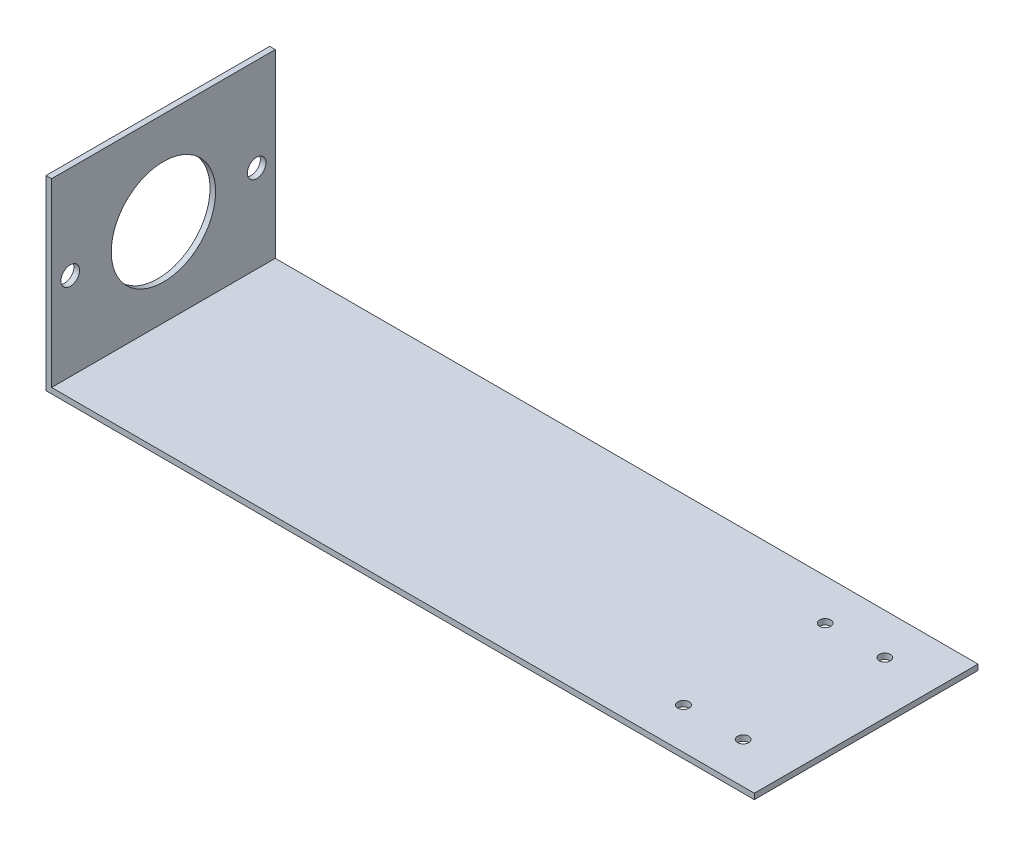
ISO-10303-21;
HEADER;
FILE_DESCRIPTION(('STEP AP214'),'2;1');
FILE_NAME('part.step','',(''),(''),'','','');
FILE_SCHEMA(('AUTOMOTIVE_DESIGN { 1 0 10303 214 1 1 1 1 }'));
ENDSEC;
DATA;
#1=APPLICATION_CONTEXT('core data for automotive mechanical design processes');
#2=APPLICATION_PROTOCOL_DEFINITION('international standard','automotive_design',2000,#1);
#3=PRODUCT_CONTEXT('',#1,'mechanical');
#4=PRODUCT('Part','Part','',(#3));
#5=PRODUCT_RELATED_PRODUCT_CATEGORY('part','',(#4));
#6=PRODUCT_DEFINITION_FORMATION('','',#4);
#7=PRODUCT_DEFINITION_CONTEXT('part definition',#1,'design');
#8=PRODUCT_DEFINITION('design','',#6,#7);
#9=PRODUCT_DEFINITION_SHAPE('','',#8);
#10=(LENGTH_UNIT() NAMED_UNIT(*) SI_UNIT(.MILLI.,.METRE.));
#11=(NAMED_UNIT(*) PLANE_ANGLE_UNIT() SI_UNIT($,.RADIAN.));
#12=(NAMED_UNIT(*) SI_UNIT($,.STERADIAN.) SOLID_ANGLE_UNIT());
#13=UNCERTAINTY_MEASURE_WITH_UNIT(LENGTH_MEASURE(1.E-05),#10,'distance_accuracy_value','');
#14=(GEOMETRIC_REPRESENTATION_CONTEXT(3) GLOBAL_UNCERTAINTY_ASSIGNED_CONTEXT((#13)) GLOBAL_UNIT_ASSIGNED_CONTEXT((#10,
#11,#12)) REPRESENTATION_CONTEXT('',''));
#15=CARTESIAN_POINT('',(0.,0.,0.));
#16=DIRECTION('',(0.,0.,1.));
#17=DIRECTION('',(1.,0.,0.));
#18=AXIS2_PLACEMENT_3D('',#15,#16,#17);
#19=CARTESIAN_POINT('',(190.,0.,60.));
#20=DIRECTION('',(0.,1.,0.));
#21=DIRECTION('',(-1.,0.,0.));
#22=AXIS2_PLACEMENT_3D('',#19,#20,#21);
#23=PLANE('',#22);
#24=CARTESIAN_POINT('',(160.,0.,49.));
#25=DIRECTION('',(0.,1.,0.));
#26=DIRECTION('',(-1.,0.,0.));
#27=AXIS2_PLACEMENT_3D('',#24,#25,#26);
#28=CIRCLE('',#27,1.5);
#29=CARTESIAN_POINT('',(158.5,0.,49.));
#30=VERTEX_POINT('',#29);
#31=EDGE_CURVE('E184',#30,#30,#28,.F.);
#32=ORIENTED_EDGE('',*,*,#31,.F.);
#33=EDGE_LOOP('',(#32));
#34=FACE_BOUND('',#33,.T.);
#35=CARTESIAN_POINT('',(176.,0.,49.));
#36=DIRECTION('',(0.,1.,0.));
#37=DIRECTION('',(-1.,0.,0.));
#38=AXIS2_PLACEMENT_3D('',#35,#36,#37);
#39=CIRCLE('',#38,1.5);
#40=CARTESIAN_POINT('',(174.5,0.,49.));
#41=VERTEX_POINT('',#40);
#42=EDGE_CURVE('E188',#41,#41,#39,.F.);
#43=ORIENTED_EDGE('',*,*,#42,.F.);
#44=EDGE_LOOP('',(#43));
#45=FACE_BOUND('',#44,.T.);
#46=CARTESIAN_POINT('',(176.,0.,11.));
#47=DIRECTION('',(0.,1.,0.));
#48=DIRECTION('',(-1.,0.,0.));
#49=AXIS2_PLACEMENT_3D('',#46,#47,#48);
#50=CIRCLE('',#49,1.5);
#51=CARTESIAN_POINT('',(174.5,0.,11.));
#52=VERTEX_POINT('',#51);
#53=EDGE_CURVE('E192',#52,#52,#50,.F.);
#54=ORIENTED_EDGE('',*,*,#53,.F.);
#55=EDGE_LOOP('',(#54));
#56=FACE_BOUND('',#55,.T.);
#57=CARTESIAN_POINT('',(160.,0.,11.));
#58=DIRECTION('',(0.,1.,0.));
#59=DIRECTION('',(-1.,0.,0.));
#60=AXIS2_PLACEMENT_3D('',#57,#58,#59);
#61=CIRCLE('',#60,1.5);
#62=CARTESIAN_POINT('',(158.5,0.,11.));
#63=VERTEX_POINT('',#62);
#64=EDGE_CURVE('E195',#63,#63,#61,.F.);
#65=ORIENTED_EDGE('',*,*,#64,.F.);
#66=EDGE_LOOP('',(#65));
#67=FACE_BOUND('',#66,.T.);
#68=DIRECTION('',(1.,0.,0.));
#69=VECTOR('',#68,1.);
#70=CARTESIAN_POINT('',(190.,0.,0.));
#71=LINE('',#70,#69);
#72=CARTESIAN_POINT('',(0.,0.,0.));
#73=VERTEX_POINT('',#72);
#74=CARTESIAN_POINT('',(190.,0.,0.));
#75=VERTEX_POINT('',#74);
#76=EDGE_CURVE('E128',#73,#75,#71,.T.);
#77=ORIENTED_EDGE('',*,*,#76,.T.);
#78=DIRECTION('',(0.,0.,-1.));
#79=VECTOR('',#78,1.);
#80=CARTESIAN_POINT('',(190.,0.,60.));
#81=LINE('',#80,#79);
#82=CARTESIAN_POINT('',(190.,0.,60.));
#83=VERTEX_POINT('',#82);
#84=EDGE_CURVE('E11',#83,#75,#81,.T.);
#85=ORIENTED_EDGE('',*,*,#84,.F.);
#86=DIRECTION('',(1.,0.,0.));
#87=VECTOR('',#86,1.);
#88=CARTESIAN_POINT('',(190.,0.,60.));
#89=LINE('',#88,#87);
#90=CARTESIAN_POINT('',(0.,0.,60.));
#91=VERTEX_POINT('',#90);
#92=EDGE_CURVE('E145',#91,#83,#89,.T.);
#93=ORIENTED_EDGE('',*,*,#92,.F.);
#94=DIRECTION('',(0.,0.,-1.));
#95=VECTOR('',#94,1.);
#96=CARTESIAN_POINT('',(0.,0.,60.));
#97=LINE('',#96,#95);
#98=EDGE_CURVE('E124',#91,#73,#97,.T.);
#99=ORIENTED_EDGE('',*,*,#98,.T.);
#100=EDGE_LOOP('',(#77,#85,#93,#99));
#101=FACE_BOUND('',#100,.T.);
#102=ADVANCED_FACE('F39',(#34,#45,#56,#67,#101),#23,.F.);
#103=CARTESIAN_POINT('',(190.,1.49999999999998,60.));
#104=DIRECTION('',(-1.,0.,0.));
#105=DIRECTION('',(0.,0.,1.));
#106=AXIS2_PLACEMENT_3D('',#103,#104,#105);
#107=PLANE('',#106);
#108=DIRECTION('',(0.,1.,0.));
#109=VECTOR('',#108,1.);
#110=CARTESIAN_POINT('',(190.,1.49999999999998,0.));
#111=LINE('',#110,#109);
#112=CARTESIAN_POINT('',(190.,1.49999999999998,0.));
#113=VERTEX_POINT('',#112);
#114=EDGE_CURVE('E132',#75,#113,#111,.T.);
#115=ORIENTED_EDGE('',*,*,#114,.T.);
#116=DIRECTION('',(0.,0.,-1.));
#117=VECTOR('',#116,1.);
#118=CARTESIAN_POINT('',(190.,1.49999999999998,60.));
#119=LINE('',#118,#117);
#120=CARTESIAN_POINT('',(190.,1.49999999999998,60.));
#121=VERTEX_POINT('',#120);
#122=EDGE_CURVE('E48',#121,#113,#119,.T.);
#123=ORIENTED_EDGE('',*,*,#122,.F.);
#124=DIRECTION('',(0.,1.,0.));
#125=VECTOR('',#124,1.);
#126=CARTESIAN_POINT('',(190.,1.49999999999998,60.));
#127=LINE('',#126,#125);
#128=EDGE_CURVE('E93',#83,#121,#127,.T.);
#129=ORIENTED_EDGE('',*,*,#128,.F.);
#130=ORIENTED_EDGE('',*,*,#84,.T.);
#131=EDGE_LOOP('',(#115,#123,#129,#130));
#132=FACE_BOUND('',#131,.T.);
#133=ADVANCED_FACE('F176',(#132),#107,.F.);
#134=CARTESIAN_POINT('',(1.50000000000001,1.49999999999998,60.));
#135=DIRECTION('',(0.,-1.,0.));
#136=DIRECTION('',(1.,0.,0.));
#137=AXIS2_PLACEMENT_3D('',#134,#135,#136);
#138=PLANE('',#137);
#139=CARTESIAN_POINT('',(160.,1.49999999999998,49.));
#140=DIRECTION('',(0.,1.,0.));
#141=DIRECTION('',(1.,0.,0.));
#142=AXIS2_PLACEMENT_3D('',#139,#140,#141);
#143=CIRCLE('',#142,1.5);
#144=CARTESIAN_POINT('',(161.5,1.49999999999998,49.));
#145=VERTEX_POINT('',#144);
#146=EDGE_CURVE('E283',#145,#145,#143,.T.);
#147=ORIENTED_EDGE('',*,*,#146,.F.);
#148=EDGE_LOOP('',(#147));
#149=FACE_BOUND('',#148,.T.);
#150=CARTESIAN_POINT('',(176.,1.49999999999998,49.));
#151=DIRECTION('',(0.,1.,0.));
#152=DIRECTION('',(1.,0.,0.));
#153=AXIS2_PLACEMENT_3D('',#150,#151,#152);
#154=CIRCLE('',#153,1.5);
#155=CARTESIAN_POINT('',(177.5,1.49999999999998,49.));
#156=VERTEX_POINT('',#155);
#157=EDGE_CURVE('E277',#156,#156,#154,.T.);
#158=ORIENTED_EDGE('',*,*,#157,.F.);
#159=EDGE_LOOP('',(#158));
#160=FACE_BOUND('',#159,.T.);
#161=CARTESIAN_POINT('',(176.,1.49999999999998,11.));
#162=DIRECTION('',(0.,1.,0.));
#163=DIRECTION('',(-1.,0.,0.));
#164=AXIS2_PLACEMENT_3D('',#161,#162,#163);
#165=CIRCLE('',#164,1.5);
#166=CARTESIAN_POINT('',(174.5,1.49999999999998,11.));
#167=VERTEX_POINT('',#166);
#168=EDGE_CURVE('E271',#167,#167,#165,.T.);
#169=ORIENTED_EDGE('',*,*,#168,.F.);
#170=EDGE_LOOP('',(#169));
#171=FACE_BOUND('',#170,.T.);
#172=CARTESIAN_POINT('',(160.,1.49999999999998,11.));
#173=DIRECTION('',(0.,1.,0.));
#174=DIRECTION('',(-1.,0.,0.));
#175=AXIS2_PLACEMENT_3D('',#172,#173,#174);
#176=CIRCLE('',#175,1.5);
#177=CARTESIAN_POINT('',(158.5,1.49999999999998,11.));
#178=VERTEX_POINT('',#177);
#179=EDGE_CURVE('E199',#178,#178,#176,.T.);
#180=ORIENTED_EDGE('',*,*,#179,.F.);
#181=EDGE_LOOP('',(#180));
#182=FACE_BOUND('',#181,.T.);
#183=DIRECTION('',(-1.,0.,0.));
#184=VECTOR('',#183,1.);
#185=CARTESIAN_POINT('',(1.50000000000001,1.49999999999998,0.));
#186=LINE('',#185,#184);
#187=CARTESIAN_POINT('',(1.50000000000001,1.49999999999998,0.));
#188=VERTEX_POINT('',#187);
#189=EDGE_CURVE('E136',#113,#188,#186,.T.);
#190=ORIENTED_EDGE('',*,*,#189,.T.);
#191=DIRECTION('',(0.,0.,-1.));
#192=VECTOR('',#191,1.);
#193=CARTESIAN_POINT('',(1.50000000000001,1.49999999999998,60.));
#194=LINE('',#193,#192);
#195=CARTESIAN_POINT('',(1.50000000000001,1.49999999999998,60.));
#196=VERTEX_POINT('',#195);
#197=EDGE_CURVE('E117',#196,#188,#194,.T.);
#198=ORIENTED_EDGE('',*,*,#197,.F.);
#199=DIRECTION('',(-1.,0.,0.));
#200=VECTOR('',#199,1.);
#201=CARTESIAN_POINT('',(1.50000000000001,1.49999999999998,60.));
#202=LINE('',#201,#200);
#203=EDGE_CURVE('E106',#121,#196,#202,.T.);
#204=ORIENTED_EDGE('',*,*,#203,.F.);
#205=ORIENTED_EDGE('',*,*,#122,.T.);
#206=EDGE_LOOP('',(#190,#198,#204,#205));
#207=FACE_BOUND('',#206,.T.);
#208=ADVANCED_FACE('F155',(#149,#160,#171,#182,#207),#138,.F.);
#209=CARTESIAN_POINT('',(1.5,50.,60.));
#210=DIRECTION('',(-1.,0.,0.));
#211=DIRECTION('',(0.,-1.,0.));
#212=AXIS2_PLACEMENT_3D('',#209,#210,#211);
#213=PLANE('',#212);
#214=CARTESIAN_POINT('',(1.5,25.,5.));
#215=DIRECTION('',(1.,0.,0.));
#216=DIRECTION('',(0.,-1.,0.));
#217=AXIS2_PLACEMENT_3D('',#214,#215,#216);
#218=CIRCLE('',#217,2.5);
#219=CARTESIAN_POINT('',(1.5,22.5,5.));
#220=VERTEX_POINT('',#219);
#221=EDGE_CURVE('E198',#220,#220,#218,.T.);
#222=ORIENTED_EDGE('',*,*,#221,.F.);
#223=EDGE_LOOP('',(#222));
#224=FACE_BOUND('',#223,.T.);
#225=CARTESIAN_POINT('',(1.5,25.,55.));
#226=DIRECTION('',(1.,0.,0.));
#227=DIRECTION('',(0.,1.,0.));
#228=AXIS2_PLACEMENT_3D('',#225,#226,#227);
#229=CIRCLE('',#228,2.5);
#230=CARTESIAN_POINT('',(1.5,27.5,55.));
#231=VERTEX_POINT('',#230);
#232=EDGE_CURVE('E210',#231,#231,#229,.T.);
#233=ORIENTED_EDGE('',*,*,#232,.F.);
#234=EDGE_LOOP('',(#233));
#235=FACE_BOUND('',#234,.T.);
#236=CARTESIAN_POINT('',(1.5,25.,30.));
#237=DIRECTION('',(1.,0.,0.));
#238=DIRECTION('',(0.,1.,0.));
#239=AXIS2_PLACEMENT_3D('',#236,#237,#238);
#240=CIRCLE('',#239,14.);
#241=CARTESIAN_POINT('',(1.5,39.,30.));
#242=VERTEX_POINT('',#241);
#243=EDGE_CURVE('E217',#242,#242,#240,.T.);
#244=ORIENTED_EDGE('',*,*,#243,.F.);
#245=EDGE_LOOP('',(#244));
#246=FACE_BOUND('',#245,.T.);
#247=DIRECTION('',(0.,1.,0.));
#248=VECTOR('',#247,1.);
#249=CARTESIAN_POINT('',(1.5,50.,0.));
#250=LINE('',#249,#248);
#251=CARTESIAN_POINT('',(1.5,50.,0.));
#252=VERTEX_POINT('',#251);
#253=EDGE_CURVE('E115',#188,#252,#250,.T.);
#254=ORIENTED_EDGE('',*,*,#253,.T.);
#255=DIRECTION('',(0.,0.,-1.));
#256=VECTOR('',#255,1.);
#257=CARTESIAN_POINT('',(1.5,50.,60.));
#258=LINE('',#257,#256);
#259=CARTESIAN_POINT('',(1.5,50.,60.));
#260=VERTEX_POINT('',#259);
#261=EDGE_CURVE('E112',#260,#252,#258,.T.);
#262=ORIENTED_EDGE('',*,*,#261,.F.);
#263=DIRECTION('',(0.,1.,0.));
#264=VECTOR('',#263,1.);
#265=CARTESIAN_POINT('',(1.5,50.,60.));
#266=LINE('',#265,#264);
#267=EDGE_CURVE('E100',#196,#260,#266,.T.);
#268=ORIENTED_EDGE('',*,*,#267,.F.);
#269=ORIENTED_EDGE('',*,*,#197,.T.);
#270=EDGE_LOOP('',(#254,#262,#268,#269));
#271=FACE_BOUND('',#270,.T.);
#272=ADVANCED_FACE('F113',(#224,#235,#246,#271),#213,.F.);
#273=CARTESIAN_POINT('',(0.,50.,60.));
#274=DIRECTION('',(0.,-1.,0.));
#275=DIRECTION('',(0.,0.,-1.));
#276=AXIS2_PLACEMENT_3D('',#273,#274,#275);
#277=PLANE('',#276);
#278=DIRECTION('',(-1.,0.,0.));
#279=VECTOR('',#278,1.);
#280=CARTESIAN_POINT('',(0.,50.,0.));
#281=LINE('',#280,#279);
#282=CARTESIAN_POINT('',(0.,50.,0.));
#283=VERTEX_POINT('',#282);
#284=EDGE_CURVE('E79',#252,#283,#281,.T.);
#285=ORIENTED_EDGE('',*,*,#284,.T.);
#286=DIRECTION('',(0.,0.,-1.));
#287=VECTOR('',#286,1.);
#288=CARTESIAN_POINT('',(0.,50.,60.));
#289=LINE('',#288,#287);
#290=CARTESIAN_POINT('',(0.,50.,60.));
#291=VERTEX_POINT('',#290);
#292=EDGE_CURVE('E118',#291,#283,#289,.T.);
#293=ORIENTED_EDGE('',*,*,#292,.F.);
#294=DIRECTION('',(-1.,0.,0.));
#295=VECTOR('',#294,1.);
#296=CARTESIAN_POINT('',(0.,50.,60.));
#297=LINE('',#296,#295);
#298=EDGE_CURVE('E104',#260,#291,#297,.T.);
#299=ORIENTED_EDGE('',*,*,#298,.F.);
#300=ORIENTED_EDGE('',*,*,#261,.T.);
#301=EDGE_LOOP('',(#285,#293,#299,#300));
#302=FACE_BOUND('',#301,.T.);
#303=ADVANCED_FACE('F120',(#302),#277,.F.);
#304=CARTESIAN_POINT('',(0.,0.,60.));
#305=DIRECTION('',(1.,0.,0.));
#306=DIRECTION('',(0.,0.,-1.));
#307=AXIS2_PLACEMENT_3D('',#304,#305,#306);
#308=PLANE('',#307);
#309=CARTESIAN_POINT('',(0.,25.,5.));
#310=DIRECTION('',(1.,0.,0.));
#311=DIRECTION('',(0.,0.,-1.));
#312=AXIS2_PLACEMENT_3D('',#309,#310,#311);
#313=CIRCLE('',#312,2.5);
#314=CARTESIAN_POINT('',(0.,25.,2.5));
#315=VERTEX_POINT('',#314);
#316=EDGE_CURVE('E204',#315,#315,#313,.F.);
#317=ORIENTED_EDGE('',*,*,#316,.F.);
#318=EDGE_LOOP('',(#317));
#319=FACE_BOUND('',#318,.T.);
#320=CARTESIAN_POINT('',(0.,25.,55.));
#321=DIRECTION('',(1.,0.,0.));
#322=DIRECTION('',(0.,0.,-1.));
#323=AXIS2_PLACEMENT_3D('',#320,#321,#322);
#324=CIRCLE('',#323,2.5);
#325=CARTESIAN_POINT('',(0.,25.,52.5));
#326=VERTEX_POINT('',#325);
#327=EDGE_CURVE('E214',#326,#326,#324,.F.);
#328=ORIENTED_EDGE('',*,*,#327,.F.);
#329=EDGE_LOOP('',(#328));
#330=FACE_BOUND('',#329,.T.);
#331=CARTESIAN_POINT('',(0.,25.,30.));
#332=DIRECTION('',(1.,0.,0.));
#333=DIRECTION('',(0.,0.,-1.));
#334=AXIS2_PLACEMENT_3D('',#331,#332,#333);
#335=CIRCLE('',#334,14.);
#336=CARTESIAN_POINT('',(0.,25.,16.));
#337=VERTEX_POINT('',#336);
#338=EDGE_CURVE('E133',#337,#337,#335,.F.);
#339=ORIENTED_EDGE('',*,*,#338,.F.);
#340=EDGE_LOOP('',(#339));
#341=FACE_BOUND('',#340,.T.);
#342=DIRECTION('',(0.,-1.,0.));
#343=VECTOR('',#342,1.);
#344=CARTESIAN_POINT('',(0.,0.,0.));
#345=LINE('',#344,#343);
#346=EDGE_CURVE('E85',#283,#73,#345,.T.);
#347=ORIENTED_EDGE('',*,*,#346,.T.);
#348=ORIENTED_EDGE('',*,*,#98,.F.);
#349=DIRECTION('',(0.,-1.,0.));
#350=VECTOR('',#349,1.);
#351=CARTESIAN_POINT('',(0.,0.,60.));
#352=LINE('',#351,#350);
#353=EDGE_CURVE('E56',#291,#91,#352,.T.);
#354=ORIENTED_EDGE('',*,*,#353,.F.);
#355=ORIENTED_EDGE('',*,*,#292,.T.);
#356=EDGE_LOOP('',(#347,#348,#354,#355));
#357=FACE_BOUND('',#356,.T.);
#358=ADVANCED_FACE('F162',(#319,#330,#341,#357),#308,.F.);
#359=CARTESIAN_POINT('',(0.,0.,60.));
#360=DIRECTION('',(0.,0.,-1.));
#361=DIRECTION('',(-1.,0.,0.));
#362=AXIS2_PLACEMENT_3D('',#359,#360,#361);
#363=PLANE('',#362);
#364=ORIENTED_EDGE('',*,*,#92,.T.);
#365=ORIENTED_EDGE('',*,*,#128,.T.);
#366=ORIENTED_EDGE('',*,*,#203,.T.);
#367=ORIENTED_EDGE('',*,*,#267,.T.);
#368=ORIENTED_EDGE('',*,*,#298,.T.);
#369=ORIENTED_EDGE('',*,*,#353,.T.);
#370=EDGE_LOOP('',(#364,#365,#366,#367,#368,#369));
#371=FACE_BOUND('',#370,.T.);
#372=ADVANCED_FACE('F102',(#371),#363,.F.);
#373=CARTESIAN_POINT('',(0.,0.,0.));
#374=DIRECTION('',(0.,0.,-1.));
#375=DIRECTION('',(-1.,0.,0.));
#376=AXIS2_PLACEMENT_3D('',#373,#374,#375);
#377=PLANE('',#376);
#378=ORIENTED_EDGE('',*,*,#76,.F.);
#379=ORIENTED_EDGE('',*,*,#346,.F.);
#380=ORIENTED_EDGE('',*,*,#284,.F.);
#381=ORIENTED_EDGE('',*,*,#253,.F.);
#382=ORIENTED_EDGE('',*,*,#189,.F.);
#383=ORIENTED_EDGE('',*,*,#114,.F.);
#384=EDGE_LOOP('',(#378,#379,#380,#381,#382,#383));
#385=FACE_BOUND('',#384,.T.);
#386=ADVANCED_FACE('F158',(#385),#377,.T.);
#387=CARTESIAN_POINT('',(-0.00100000000000295,25.,30.));
#388=DIRECTION('',(1.,0.,0.));
#389=DIRECTION('',(0.,1.,0.));
#390=AXIS2_PLACEMENT_3D('',#387,#388,#389);
#391=CYLINDRICAL_SURFACE('',#390,14.);
#392=ORIENTED_EDGE('',*,*,#243,.T.);
#393=EDGE_LOOP('',(#392));
#394=FACE_BOUND('',#393,.T.);
#395=ORIENTED_EDGE('',*,*,#338,.T.);
#396=EDGE_LOOP('',(#395));
#397=FACE_BOUND('',#396,.T.);
#398=ADVANCED_FACE('F234',(#394,#397),#391,.F.);
#399=CARTESIAN_POINT('',(-0.00100000000000295,25.,55.));
#400=DIRECTION('',(1.,0.,0.));
#401=DIRECTION('',(0.,1.,0.));
#402=AXIS2_PLACEMENT_3D('',#399,#400,#401);
#403=CYLINDRICAL_SURFACE('',#402,2.5);
#404=ORIENTED_EDGE('',*,*,#232,.T.);
#405=EDGE_LOOP('',(#404));
#406=FACE_BOUND('',#405,.T.);
#407=ORIENTED_EDGE('',*,*,#327,.T.);
#408=EDGE_LOOP('',(#407));
#409=FACE_BOUND('',#408,.T.);
#410=ADVANCED_FACE('F237',(#406,#409),#403,.F.);
#411=CARTESIAN_POINT('',(-0.00100000000000295,25.,5.));
#412=DIRECTION('',(1.,0.,0.));
#413=DIRECTION('',(0.,1.,0.));
#414=AXIS2_PLACEMENT_3D('',#411,#412,#413);
#415=CYLINDRICAL_SURFACE('',#414,2.5);
#416=ORIENTED_EDGE('',*,*,#221,.T.);
#417=EDGE_LOOP('',(#416));
#418=FACE_BOUND('',#417,.T.);
#419=ORIENTED_EDGE('',*,*,#316,.T.);
#420=EDGE_LOOP('',(#419));
#421=FACE_BOUND('',#420,.T.);
#422=ADVANCED_FACE('F244',(#418,#421),#415,.F.);
#423=CARTESIAN_POINT('',(160.,-0.00100000000000013,11.));
#424=DIRECTION('',(0.,1.,0.));
#425=DIRECTION('',(-1.,0.,0.));
#426=AXIS2_PLACEMENT_3D('',#423,#424,#425);
#427=CYLINDRICAL_SURFACE('',#426,1.5);
#428=ORIENTED_EDGE('',*,*,#179,.T.);
#429=EDGE_LOOP('',(#428));
#430=FACE_BOUND('',#429,.T.);
#431=ORIENTED_EDGE('',*,*,#64,.T.);
#432=EDGE_LOOP('',(#431));
#433=FACE_BOUND('',#432,.T.);
#434=ADVANCED_FACE('F249',(#430,#433),#427,.F.);
#435=CARTESIAN_POINT('',(176.,-0.00100000000000013,11.));
#436=DIRECTION('',(0.,1.,0.));
#437=DIRECTION('',(-1.,0.,0.));
#438=AXIS2_PLACEMENT_3D('',#435,#436,#437);
#439=CYLINDRICAL_SURFACE('',#438,1.5);
#440=ORIENTED_EDGE('',*,*,#168,.T.);
#441=EDGE_LOOP('',(#440));
#442=FACE_BOUND('',#441,.T.);
#443=ORIENTED_EDGE('',*,*,#53,.T.);
#444=EDGE_LOOP('',(#443));
#445=FACE_BOUND('',#444,.T.);
#446=ADVANCED_FACE('F254',(#442,#445),#439,.F.);
#447=CARTESIAN_POINT('',(176.,-0.00100000000000013,49.));
#448=DIRECTION('',(0.,1.,0.));
#449=DIRECTION('',(-1.,0.,0.));
#450=AXIS2_PLACEMENT_3D('',#447,#448,#449);
#451=CYLINDRICAL_SURFACE('',#450,1.5);
#452=ORIENTED_EDGE('',*,*,#157,.T.);
#453=EDGE_LOOP('',(#452));
#454=FACE_BOUND('',#453,.T.);
#455=ORIENTED_EDGE('',*,*,#42,.T.);
#456=EDGE_LOOP('',(#455));
#457=FACE_BOUND('',#456,.T.);
#458=ADVANCED_FACE('F259',(#454,#457),#451,.F.);
#459=CARTESIAN_POINT('',(160.,-0.00100000000000013,49.));
#460=DIRECTION('',(0.,1.,0.));
#461=DIRECTION('',(-1.,0.,0.));
#462=AXIS2_PLACEMENT_3D('',#459,#460,#461);
#463=CYLINDRICAL_SURFACE('',#462,1.5);
#464=ORIENTED_EDGE('',*,*,#146,.T.);
#465=EDGE_LOOP('',(#464));
#466=FACE_BOUND('',#465,.T.);
#467=ORIENTED_EDGE('',*,*,#31,.T.);
#468=EDGE_LOOP('',(#467));
#469=FACE_BOUND('',#468,.T.);
#470=ADVANCED_FACE('F256',(#466,#469),#463,.F.);
#471=CLOSED_SHELL('',(#102,#133,#208,#272,#303,#358,#372,#386,#398,#410,#422,#434,#446,#458,#470));
#472=MANIFOLD_SOLID_BREP('B2',#471);
#473=ADVANCED_BREP_SHAPE_REPRESENTATION('',(#18,#472),#14);
#474=SHAPE_DEFINITION_REPRESENTATION(#9,#473);
ENDSEC;
END-ISO-10303-21;
